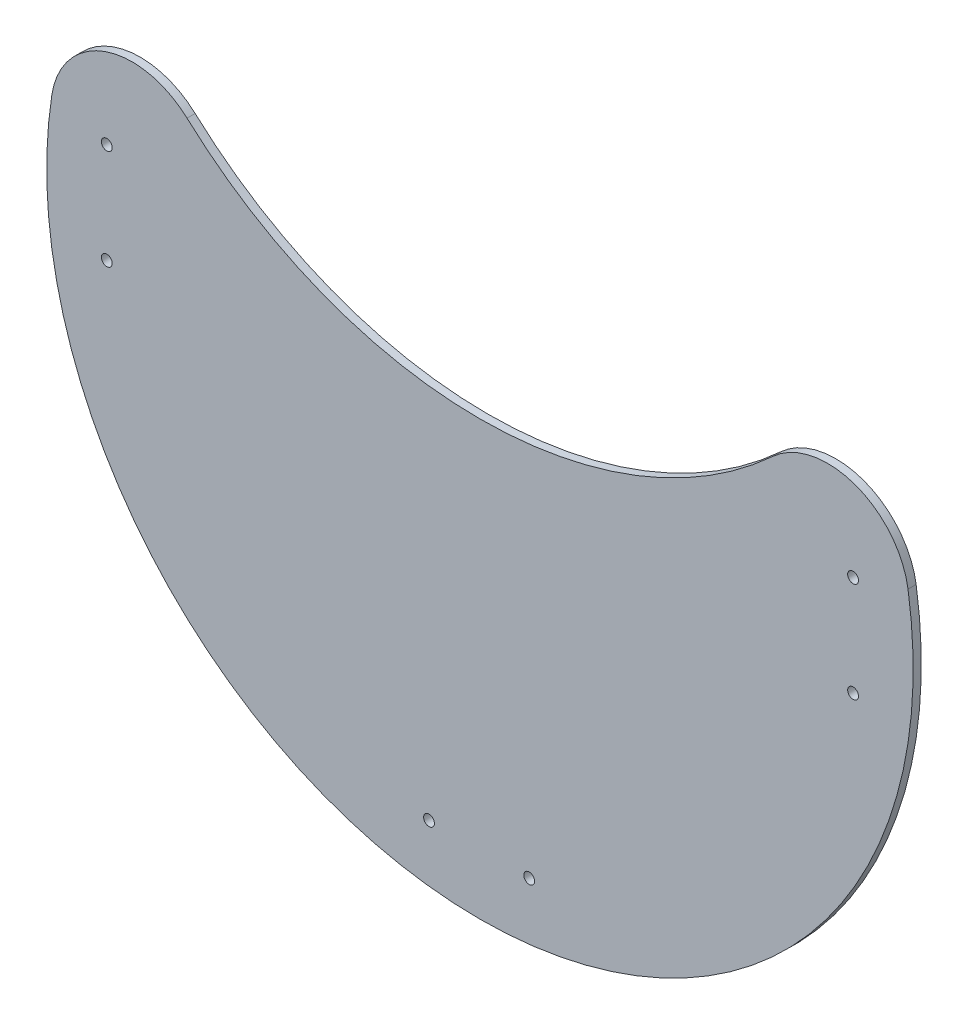
ISO-10303-21;
HEADER;
FILE_DESCRIPTION(('STEP AP214'),'2;1');
FILE_NAME('part.step','',(''),(''),'','','');
FILE_SCHEMA(('AUTOMOTIVE_DESIGN { 1 0 10303 214 1 1 1 1 }'));
ENDSEC;
DATA;
#1=APPLICATION_CONTEXT('core data for automotive mechanical design processes');
#2=APPLICATION_PROTOCOL_DEFINITION('international standard','automotive_design',2000,#1);
#3=PRODUCT_CONTEXT('',#1,'mechanical');
#4=PRODUCT('Part','Part','',(#3));
#5=PRODUCT_RELATED_PRODUCT_CATEGORY('part','',(#4));
#6=PRODUCT_DEFINITION_FORMATION('','',#4);
#7=PRODUCT_DEFINITION_CONTEXT('part definition',#1,'design');
#8=PRODUCT_DEFINITION('design','',#6,#7);
#9=PRODUCT_DEFINITION_SHAPE('','',#8);
#10=(LENGTH_UNIT() NAMED_UNIT(*) SI_UNIT(.MILLI.,.METRE.));
#11=(NAMED_UNIT(*) PLANE_ANGLE_UNIT() SI_UNIT($,.RADIAN.));
#12=(NAMED_UNIT(*) SI_UNIT($,.STERADIAN.) SOLID_ANGLE_UNIT());
#13=UNCERTAINTY_MEASURE_WITH_UNIT(LENGTH_MEASURE(1.E-05),#10,'distance_accuracy_value','');
#14=(GEOMETRIC_REPRESENTATION_CONTEXT(3) GLOBAL_UNCERTAINTY_ASSIGNED_CONTEXT((#13)) GLOBAL_UNIT_ASSIGNED_CONTEXT((#10,
#11,#12)) REPRESENTATION_CONTEXT('',''));
#15=CARTESIAN_POINT('',(0.,0.,0.));
#16=DIRECTION('',(0.,0.,1.));
#17=DIRECTION('',(1.,0.,0.));
#18=AXIS2_PLACEMENT_3D('',#15,#16,#17);
#19=CARTESIAN_POINT('',(-64.2261628933256,9.99999999999999,3.));
#20=DIRECTION('',(0.,0.,1.));
#21=DIRECTION('',(1.,0.,0.));
#22=AXIS2_PLACEMENT_3D('',#19,#20,#21);
#23=PLANE('',#22);
#24=CARTESIAN_POINT('',(-137.799674335736,-18.1958235612835,3.));
#25=DIRECTION('',(0.,0.,1.));
#26=DIRECTION('',(1.,0.,0.));
#27=AXIS2_PLACEMENT_3D('',#24,#25,#26);
#28=CIRCLE('',#27,1.99999999999933);
#29=CARTESIAN_POINT('',(-135.799674335737,-18.1958235612835,3.));
#30=VERTEX_POINT('',#29);
#31=EDGE_CURVE('E158',#30,#30,#28,.T.);
#32=ORIENTED_EDGE('',*,*,#31,.F.);
#33=EDGE_LOOP('',(#32));
#34=FACE_BOUND('',#33,.T.);
#35=CARTESIAN_POINT('',(18.1958235612711,-137.799674335758,3.));
#36=DIRECTION('',(0.,0.,1.));
#37=DIRECTION('',(1.,0.,0.));
#38=AXIS2_PLACEMENT_3D('',#35,#36,#37);
#39=CIRCLE('',#38,1.99999999999934);
#40=CARTESIAN_POINT('',(20.1958235612705,-137.799674335758,3.));
#41=VERTEX_POINT('',#40);
#42=EDGE_CURVE('E142',#41,#41,#39,.T.);
#43=ORIENTED_EDGE('',*,*,#42,.F.);
#44=EDGE_LOOP('',(#43));
#45=FACE_BOUND('',#44,.T.);
#46=CARTESIAN_POINT('',(137.79967433574,18.1958235612539,3.));
#47=DIRECTION('',(0.,0.,1.));
#48=DIRECTION('',(1.,0.,0.));
#49=AXIS2_PLACEMENT_3D('',#46,#47,#48);
#50=CIRCLE('',#49,1.99999999999933);
#51=CARTESIAN_POINT('',(139.799674335739,18.1958235612539,3.));
#52=VERTEX_POINT('',#51);
#53=EDGE_CURVE('E112',#52,#52,#50,.T.);
#54=ORIENTED_EDGE('',*,*,#53,.F.);
#55=EDGE_LOOP('',(#54));
#56=FACE_BOUND('',#55,.T.);
#57=CARTESIAN_POINT('',(-128.452325786651,20.,3.));
#58=DIRECTION('',(0.,0.,1.));
#59=DIRECTION('',(1.,0.,0.));
#60=AXIS2_PLACEMENT_3D('',#57,#58,#59);
#61=CIRCLE('',#60,30.);
#62=CARTESIAN_POINT('',(-108.170379609812,42.1052631578947,3.));
#63=VERTEX_POINT('',#62);
#64=CARTESIAN_POINT('',(-158.095170198955,24.6153846153846,3.));
#65=VERTEX_POINT('',#64);
#66=EDGE_CURVE('E92',#63,#65,#61,.T.);
#67=ORIENTED_EDGE('',*,*,#66,.T.);
#68=CARTESIAN_POINT('',(0.,0.,3.));
#69=DIRECTION('',(0.,0.,1.));
#70=DIRECTION('',(1.,0.,0.));
#71=AXIS2_PLACEMENT_3D('',#68,#69,#70);
#72=CIRCLE('',#71,160.);
#73=CARTESIAN_POINT('',(158.095170198955,24.6153846153846,3.));
#74=VERTEX_POINT('',#73);
#75=EDGE_CURVE('E87',#65,#74,#72,.T.);
#76=ORIENTED_EDGE('',*,*,#75,.T.);
#77=CARTESIAN_POINT('',(128.452325786651,20.,3.));
#78=DIRECTION('',(0.,0.,1.));
#79=DIRECTION('',(1.,0.,0.));
#80=AXIS2_PLACEMENT_3D('',#77,#78,#79);
#81=CIRCLE('',#80,30.);
#82=CARTESIAN_POINT('',(108.170379609812,42.1052631578947,3.));
#83=VERTEX_POINT('',#82);
#84=EDGE_CURVE('E90',#74,#83,#81,.T.);
#85=ORIENTED_EDGE('',*,*,#84,.T.);
#86=CARTESIAN_POINT('',(0.,160.,3.));
#87=DIRECTION('',(0.,0.,-1.));
#88=DIRECTION('',(1.,0.,0.));
#89=AXIS2_PLACEMENT_3D('',#86,#87,#88);
#90=CIRCLE('',#89,160.);
#91=EDGE_CURVE('E57',#83,#63,#90,.T.);
#92=ORIENTED_EDGE('',*,*,#91,.T.);
#93=EDGE_LOOP('',(#67,#76,#85,#92));
#94=FACE_BOUND('',#93,.T.);
#95=CARTESIAN_POINT('',(137.79967433574,-18.8041764387461,3.));
#96=DIRECTION('',(0.,0.,1.));
#97=DIRECTION('',(1.,0.,0.));
#98=AXIS2_PLACEMENT_3D('',#95,#96,#97);
#99=CIRCLE('',#98,2.00000000000836);
#100=CARTESIAN_POINT('',(139.799674335748,-18.8041764387461,3.));
#101=VERTEX_POINT('',#100);
#102=EDGE_CURVE('E134',#101,#101,#99,.T.);
#103=ORIENTED_EDGE('',*,*,#102,.F.);
#104=EDGE_LOOP('',(#103));
#105=FACE_BOUND('',#104,.T.);
#106=CARTESIAN_POINT('',(-18.8041764387288,-137.799674335757,3.));
#107=DIRECTION('',(0.,0.,1.));
#108=DIRECTION('',(1.,0.,0.));
#109=AXIS2_PLACEMENT_3D('',#106,#107,#108);
#110=CIRCLE('',#109,2.00000000000836);
#111=CARTESIAN_POINT('',(-16.8041764387205,-137.799674335757,3.));
#112=VERTEX_POINT('',#111);
#113=EDGE_CURVE('E150',#112,#112,#110,.T.);
#114=ORIENTED_EDGE('',*,*,#113,.F.);
#115=EDGE_LOOP('',(#114));
#116=FACE_BOUND('',#115,.T.);
#117=CARTESIAN_POINT('',(-137.799674335734,18.8041764387165,3.));
#118=DIRECTION('',(0.,0.,1.));
#119=DIRECTION('',(1.,0.,0.));
#120=AXIS2_PLACEMENT_3D('',#117,#118,#119);
#121=CIRCLE('',#120,2.00000000000836);
#122=CARTESIAN_POINT('',(-135.799674335725,18.8041764387165,3.));
#123=VERTEX_POINT('',#122);
#124=EDGE_CURVE('E166',#123,#123,#121,.T.);
#125=ORIENTED_EDGE('',*,*,#124,.F.);
#126=EDGE_LOOP('',(#125));
#127=FACE_BOUND('',#126,.T.);
#128=ADVANCED_FACE('F39',(#34,#45,#56,#94,#105,#116,#127),#23,.T.);
#129=CARTESIAN_POINT('',(-64.2261628933256,9.99999999999999,0.));
#130=DIRECTION('',(0.,0.,1.));
#131=DIRECTION('',(1.,0.,0.));
#132=AXIS2_PLACEMENT_3D('',#129,#130,#131);
#133=PLANE('',#132);
#134=CARTESIAN_POINT('',(-128.452325786651,20.,0.));
#135=DIRECTION('',(0.,0.,1.));
#136=DIRECTION('',(1.,0.,0.));
#137=AXIS2_PLACEMENT_3D('',#134,#135,#136);
#138=CIRCLE('',#137,30.);
#139=CARTESIAN_POINT('',(-108.170379609812,42.1052631578947,0.));
#140=VERTEX_POINT('',#139);
#141=CARTESIAN_POINT('',(-158.095170198955,24.6153846153846,0.));
#142=VERTEX_POINT('',#141);
#143=EDGE_CURVE('E108',#140,#142,#138,.T.);
#144=ORIENTED_EDGE('',*,*,#143,.F.);
#145=CARTESIAN_POINT('',(0.,160.,0.));
#146=DIRECTION('',(0.,0.,-1.));
#147=DIRECTION('',(1.,0.,0.));
#148=AXIS2_PLACEMENT_3D('',#145,#146,#147);
#149=CIRCLE('',#148,160.);
#150=CARTESIAN_POINT('',(108.170379609812,42.1052631578947,0.));
#151=VERTEX_POINT('',#150);
#152=EDGE_CURVE('E80',#151,#140,#149,.T.);
#153=ORIENTED_EDGE('',*,*,#152,.F.);
#154=CARTESIAN_POINT('',(128.452325786651,20.,0.));
#155=DIRECTION('',(0.,0.,1.));
#156=DIRECTION('',(1.,0.,0.));
#157=AXIS2_PLACEMENT_3D('',#154,#155,#156);
#158=CIRCLE('',#157,30.);
#159=CARTESIAN_POINT('',(158.095170198955,24.6153846153846,0.));
#160=VERTEX_POINT('',#159);
#161=EDGE_CURVE('E74',#160,#151,#158,.T.);
#162=ORIENTED_EDGE('',*,*,#161,.F.);
#163=CARTESIAN_POINT('',(0.,0.,0.));
#164=DIRECTION('',(0.,0.,1.));
#165=DIRECTION('',(1.,0.,0.));
#166=AXIS2_PLACEMENT_3D('',#163,#164,#165);
#167=CIRCLE('',#166,160.);
#168=EDGE_CURVE('E97',#142,#160,#167,.T.);
#169=ORIENTED_EDGE('',*,*,#168,.F.);
#170=EDGE_LOOP('',(#144,#153,#162,#169));
#171=FACE_BOUND('',#170,.T.);
#172=CARTESIAN_POINT('',(137.79967433574,18.1958235612539,0.));
#173=DIRECTION('',(0.,0.,1.));
#174=DIRECTION('',(1.,0.,0.));
#175=AXIS2_PLACEMENT_3D('',#172,#173,#174);
#176=CIRCLE('',#175,1.99999999999933);
#177=CARTESIAN_POINT('',(139.799674335739,18.1958235612539,0.));
#178=VERTEX_POINT('',#177);
#179=EDGE_CURVE('E130',#178,#178,#176,.T.);
#180=ORIENTED_EDGE('',*,*,#179,.T.);
#181=EDGE_LOOP('',(#180));
#182=FACE_BOUND('',#181,.T.);
#183=CARTESIAN_POINT('',(137.79967433574,-18.8041764387461,0.));
#184=DIRECTION('',(0.,0.,1.));
#185=DIRECTION('',(1.,0.,0.));
#186=AXIS2_PLACEMENT_3D('',#183,#184,#185);
#187=CIRCLE('',#186,2.00000000000836);
#188=CARTESIAN_POINT('',(139.799674335748,-18.8041764387461,0.));
#189=VERTEX_POINT('',#188);
#190=EDGE_CURVE('E138',#189,#189,#187,.T.);
#191=ORIENTED_EDGE('',*,*,#190,.T.);
#192=EDGE_LOOP('',(#191));
#193=FACE_BOUND('',#192,.T.);
#194=CARTESIAN_POINT('',(18.1958235612711,-137.799674335758,0.));
#195=DIRECTION('',(0.,0.,1.));
#196=DIRECTION('',(1.,0.,0.));
#197=AXIS2_PLACEMENT_3D('',#194,#195,#196);
#198=CIRCLE('',#197,1.99999999999934);
#199=CARTESIAN_POINT('',(20.1958235612705,-137.799674335758,0.));
#200=VERTEX_POINT('',#199);
#201=EDGE_CURVE('E146',#200,#200,#198,.T.);
#202=ORIENTED_EDGE('',*,*,#201,.T.);
#203=EDGE_LOOP('',(#202));
#204=FACE_BOUND('',#203,.T.);
#205=CARTESIAN_POINT('',(-18.8041764387288,-137.799674335757,0.));
#206=DIRECTION('',(0.,0.,1.));
#207=DIRECTION('',(1.,0.,0.));
#208=AXIS2_PLACEMENT_3D('',#205,#206,#207);
#209=CIRCLE('',#208,2.00000000000836);
#210=CARTESIAN_POINT('',(-16.8041764387205,-137.799674335757,0.));
#211=VERTEX_POINT('',#210);
#212=EDGE_CURVE('E154',#211,#211,#209,.T.);
#213=ORIENTED_EDGE('',*,*,#212,.T.);
#214=EDGE_LOOP('',(#213));
#215=FACE_BOUND('',#214,.T.);
#216=CARTESIAN_POINT('',(-137.799674335736,-18.1958235612835,0.));
#217=DIRECTION('',(0.,0.,1.));
#218=DIRECTION('',(1.,0.,0.));
#219=AXIS2_PLACEMENT_3D('',#216,#217,#218);
#220=CIRCLE('',#219,1.99999999999933);
#221=CARTESIAN_POINT('',(-135.799674335737,-18.1958235612835,0.));
#222=VERTEX_POINT('',#221);
#223=EDGE_CURVE('E162',#222,#222,#220,.T.);
#224=ORIENTED_EDGE('',*,*,#223,.T.);
#225=EDGE_LOOP('',(#224));
#226=FACE_BOUND('',#225,.T.);
#227=CARTESIAN_POINT('',(-137.799674335734,18.8041764387165,0.));
#228=DIRECTION('',(0.,0.,1.));
#229=DIRECTION('',(1.,0.,0.));
#230=AXIS2_PLACEMENT_3D('',#227,#228,#229);
#231=CIRCLE('',#230,2.00000000000836);
#232=CARTESIAN_POINT('',(-135.799674335725,18.8041764387165,0.));
#233=VERTEX_POINT('',#232);
#234=EDGE_CURVE('E170',#233,#233,#231,.T.);
#235=ORIENTED_EDGE('',*,*,#234,.T.);
#236=EDGE_LOOP('',(#235));
#237=FACE_BOUND('',#236,.T.);
#238=ADVANCED_FACE('F125',(#171,#182,#193,#204,#215,#226,#237),#133,.F.);
#239=CARTESIAN_POINT('',(-128.452325786651,20.,3.));
#240=DIRECTION('',(0.,0.,-1.));
#241=DIRECTION('',(-1.,0.,0.));
#242=AXIS2_PLACEMENT_3D('',#239,#240,#241);
#243=CYLINDRICAL_SURFACE('',#242,30.);
#244=ORIENTED_EDGE('',*,*,#143,.T.);
#245=DIRECTION('',(0.,0.,-1.));
#246=VECTOR('',#245,1.);
#247=CARTESIAN_POINT('',(-158.095170198955,24.6153846153846,3.));
#248=LINE('',#247,#246);
#249=EDGE_CURVE('E11',#65,#142,#248,.T.);
#250=ORIENTED_EDGE('',*,*,#249,.F.);
#251=ORIENTED_EDGE('',*,*,#66,.F.);
#252=DIRECTION('',(0.,0.,-1.));
#253=VECTOR('',#252,1.);
#254=CARTESIAN_POINT('',(-108.170379609812,42.1052631578947,3.));
#255=LINE('',#254,#253);
#256=EDGE_CURVE('E104',#63,#140,#255,.T.);
#257=ORIENTED_EDGE('',*,*,#256,.T.);
#258=EDGE_LOOP('',(#244,#250,#251,#257));
#259=FACE_BOUND('',#258,.T.);
#260=ADVANCED_FACE('F41',(#259),#243,.T.);
#261=CARTESIAN_POINT('',(0.,0.,3.));
#262=DIRECTION('',(0.,0.,-1.));
#263=DIRECTION('',(-1.,0.,0.));
#264=AXIS2_PLACEMENT_3D('',#261,#262,#263);
#265=CYLINDRICAL_SURFACE('',#264,160.);
#266=ORIENTED_EDGE('',*,*,#168,.T.);
#267=DIRECTION('',(0.,0.,-1.));
#268=VECTOR('',#267,1.);
#269=CARTESIAN_POINT('',(158.095170198955,24.6153846153846,3.));
#270=LINE('',#269,#268);
#271=EDGE_CURVE('E49',#74,#160,#270,.T.);
#272=ORIENTED_EDGE('',*,*,#271,.F.);
#273=ORIENTED_EDGE('',*,*,#75,.F.);
#274=ORIENTED_EDGE('',*,*,#249,.T.);
#275=EDGE_LOOP('',(#266,#272,#273,#274));
#276=FACE_BOUND('',#275,.T.);
#277=ADVANCED_FACE('F96',(#276),#265,.T.);
#278=CARTESIAN_POINT('',(128.452325786651,20.,3.));
#279=DIRECTION('',(0.,0.,-1.));
#280=DIRECTION('',(-1.,0.,0.));
#281=AXIS2_PLACEMENT_3D('',#278,#279,#280);
#282=CYLINDRICAL_SURFACE('',#281,30.);
#283=ORIENTED_EDGE('',*,*,#161,.T.);
#284=DIRECTION('',(0.,0.,-1.));
#285=VECTOR('',#284,1.);
#286=CARTESIAN_POINT('',(108.170379609812,42.1052631578947,3.));
#287=LINE('',#286,#285);
#288=EDGE_CURVE('E99',#83,#151,#287,.T.);
#289=ORIENTED_EDGE('',*,*,#288,.F.);
#290=ORIENTED_EDGE('',*,*,#84,.F.);
#291=ORIENTED_EDGE('',*,*,#271,.T.);
#292=EDGE_LOOP('',(#283,#289,#290,#291));
#293=FACE_BOUND('',#292,.T.);
#294=ADVANCED_FACE('F100',(#293),#282,.T.);
#295=CARTESIAN_POINT('',(0.,160.,3.));
#296=DIRECTION('',(0.,0.,-1.));
#297=DIRECTION('',(-1.,0.,0.));
#298=AXIS2_PLACEMENT_3D('',#295,#296,#297);
#299=CYLINDRICAL_SURFACE('',#298,160.);
#300=ORIENTED_EDGE('',*,*,#152,.T.);
#301=ORIENTED_EDGE('',*,*,#256,.F.);
#302=ORIENTED_EDGE('',*,*,#91,.F.);
#303=ORIENTED_EDGE('',*,*,#288,.T.);
#304=EDGE_LOOP('',(#300,#301,#302,#303));
#305=FACE_BOUND('',#304,.T.);
#306=ADVANCED_FACE('F122',(#305),#299,.F.);
#307=CARTESIAN_POINT('',(137.79967433574,18.1958235612539,3.));
#308=DIRECTION('',(0.,0.,-1.));
#309=DIRECTION('',(-1.,0.,0.));
#310=AXIS2_PLACEMENT_3D('',#307,#308,#309);
#311=CYLINDRICAL_SURFACE('',#310,1.99999999999933);
#312=ORIENTED_EDGE('',*,*,#53,.T.);
#313=EDGE_LOOP('',(#312));
#314=FACE_BOUND('',#313,.T.);
#315=ORIENTED_EDGE('',*,*,#179,.F.);
#316=EDGE_LOOP('',(#315));
#317=FACE_BOUND('',#316,.T.);
#318=ADVANCED_FACE('F191',(#314,#317),#311,.F.);
#319=CARTESIAN_POINT('',(137.79967433574,-18.8041764387461,3.));
#320=DIRECTION('',(0.,0.,-1.));
#321=DIRECTION('',(-1.,0.,0.));
#322=AXIS2_PLACEMENT_3D('',#319,#320,#321);
#323=CYLINDRICAL_SURFACE('',#322,2.00000000000836);
#324=ORIENTED_EDGE('',*,*,#102,.T.);
#325=EDGE_LOOP('',(#324));
#326=FACE_BOUND('',#325,.T.);
#327=ORIENTED_EDGE('',*,*,#190,.F.);
#328=EDGE_LOOP('',(#327));
#329=FACE_BOUND('',#328,.T.);
#330=ADVANCED_FACE('F237',(#326,#329),#323,.F.);
#331=CARTESIAN_POINT('',(18.1958235612711,-137.799674335758,3.));
#332=DIRECTION('',(0.,0.,-1.));
#333=DIRECTION('',(-1.,0.,0.));
#334=AXIS2_PLACEMENT_3D('',#331,#332,#333);
#335=CYLINDRICAL_SURFACE('',#334,1.99999999999934);
#336=ORIENTED_EDGE('',*,*,#42,.T.);
#337=EDGE_LOOP('',(#336));
#338=FACE_BOUND('',#337,.T.);
#339=ORIENTED_EDGE('',*,*,#201,.F.);
#340=EDGE_LOOP('',(#339));
#341=FACE_BOUND('',#340,.T.);
#342=ADVANCED_FACE('F245',(#338,#341),#335,.F.);
#343=CARTESIAN_POINT('',(-18.8041764387288,-137.799674335757,3.));
#344=DIRECTION('',(0.,0.,-1.));
#345=DIRECTION('',(-1.,0.,0.));
#346=AXIS2_PLACEMENT_3D('',#343,#344,#345);
#347=CYLINDRICAL_SURFACE('',#346,2.00000000000836);
#348=ORIENTED_EDGE('',*,*,#113,.T.);
#349=EDGE_LOOP('',(#348));
#350=FACE_BOUND('',#349,.T.);
#351=ORIENTED_EDGE('',*,*,#212,.F.);
#352=EDGE_LOOP('',(#351));
#353=FACE_BOUND('',#352,.T.);
#354=ADVANCED_FACE('F253',(#350,#353),#347,.F.);
#355=CARTESIAN_POINT('',(-137.799674335736,-18.1958235612835,3.));
#356=DIRECTION('',(0.,0.,-1.));
#357=DIRECTION('',(-1.,0.,0.));
#358=AXIS2_PLACEMENT_3D('',#355,#356,#357);
#359=CYLINDRICAL_SURFACE('',#358,1.99999999999933);
#360=ORIENTED_EDGE('',*,*,#31,.T.);
#361=EDGE_LOOP('',(#360));
#362=FACE_BOUND('',#361,.T.);
#363=ORIENTED_EDGE('',*,*,#223,.F.);
#364=EDGE_LOOP('',(#363));
#365=FACE_BOUND('',#364,.T.);
#366=ADVANCED_FACE('F262',(#362,#365),#359,.F.);
#367=CARTESIAN_POINT('',(-137.799674335734,18.8041764387165,3.));
#368=DIRECTION('',(0.,0.,-1.));
#369=DIRECTION('',(-1.,0.,0.));
#370=AXIS2_PLACEMENT_3D('',#367,#368,#369);
#371=CYLINDRICAL_SURFACE('',#370,2.00000000000836);
#372=ORIENTED_EDGE('',*,*,#124,.T.);
#373=EDGE_LOOP('',(#372));
#374=FACE_BOUND('',#373,.T.);
#375=ORIENTED_EDGE('',*,*,#234,.F.);
#376=EDGE_LOOP('',(#375));
#377=FACE_BOUND('',#376,.T.);
#378=ADVANCED_FACE('F178',(#374,#377),#371,.F.);
#379=CLOSED_SHELL('',(#128,#238,#260,#277,#294,#306,#318,#330,#342,#354,#366,#378));
#380=MANIFOLD_SOLID_BREP('B2',#379);
#381=ADVANCED_BREP_SHAPE_REPRESENTATION('',(#18,#380),#14);
#382=SHAPE_DEFINITION_REPRESENTATION(#9,#381);
ENDSEC;
END-ISO-10303-21;
